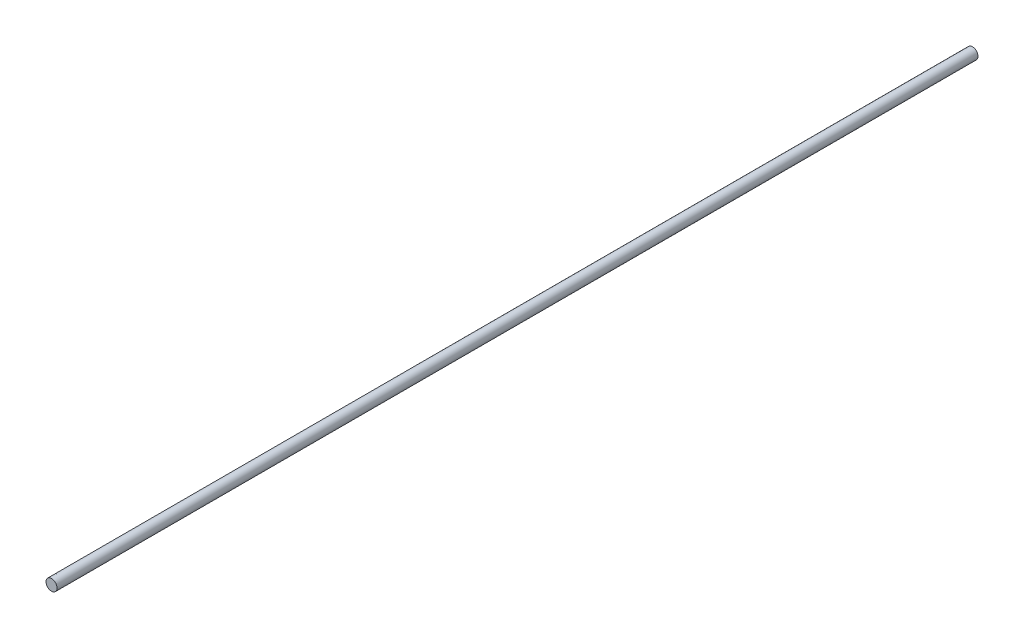
ISO-10303-21;
HEADER;
FILE_DESCRIPTION(('STEP AP214'),'2;1');
FILE_NAME('part.step','',(''),(''),'','','');
FILE_SCHEMA(('AUTOMOTIVE_DESIGN { 1 0 10303 214 1 1 1 1 }'));
ENDSEC;
DATA;
#1=APPLICATION_CONTEXT('core data for automotive mechanical design processes');
#2=APPLICATION_PROTOCOL_DEFINITION('international standard','automotive_design',2000,#1);
#3=PRODUCT_CONTEXT('',#1,'mechanical');
#4=PRODUCT('Part','Part','',(#3));
#5=PRODUCT_RELATED_PRODUCT_CATEGORY('part','',(#4));
#6=PRODUCT_DEFINITION_FORMATION('','',#4);
#7=PRODUCT_DEFINITION_CONTEXT('part definition',#1,'design');
#8=PRODUCT_DEFINITION('design','',#6,#7);
#9=PRODUCT_DEFINITION_SHAPE('','',#8);
#10=(LENGTH_UNIT() NAMED_UNIT(*) SI_UNIT(.MILLI.,.METRE.));
#11=(NAMED_UNIT(*) PLANE_ANGLE_UNIT() SI_UNIT($,.RADIAN.));
#12=(NAMED_UNIT(*) SI_UNIT($,.STERADIAN.) SOLID_ANGLE_UNIT());
#13=UNCERTAINTY_MEASURE_WITH_UNIT(LENGTH_MEASURE(1.E-05),#10,'distance_accuracy_value','');
#14=(GEOMETRIC_REPRESENTATION_CONTEXT(3) GLOBAL_UNCERTAINTY_ASSIGNED_CONTEXT((#13)) GLOBAL_UNIT_ASSIGNED_CONTEXT((#10,
#11,#12)) REPRESENTATION_CONTEXT('',''));
#15=CARTESIAN_POINT('',(0.,0.,0.));
#16=DIRECTION('',(0.,0.,1.));
#17=DIRECTION('',(1.,0.,0.));
#18=AXIS2_PLACEMENT_3D('',#15,#16,#17);
#19=CARTESIAN_POINT('',(0.,0.,1000.));
#20=DIRECTION('',(0.,0.,-1.));
#21=DIRECTION('',(-1.,0.,0.));
#22=AXIS2_PLACEMENT_3D('',#19,#20,#21);
#23=CYLINDRICAL_SURFACE('',#22,6.);
#24=CARTESIAN_POINT('',(0.,0.,1000.));
#25=DIRECTION('',(0.,0.,1.));
#26=DIRECTION('',(1.,0.,0.));
#27=AXIS2_PLACEMENT_3D('',#24,#25,#26);
#28=CIRCLE('',#27,6.);
#29=CARTESIAN_POINT('',(6.,0.,1000.));
#30=VERTEX_POINT('',#29);
#31=EDGE_CURVE('E10',#30,#30,#28,.T.);
#32=ORIENTED_EDGE('',*,*,#31,.F.);
#33=EDGE_LOOP('',(#32));
#34=FACE_BOUND('',#33,.T.);
#35=CARTESIAN_POINT('',(0.,0.,0.));
#36=DIRECTION('',(0.,0.,1.));
#37=DIRECTION('',(1.,0.,0.));
#38=AXIS2_PLACEMENT_3D('',#35,#36,#37);
#39=CIRCLE('',#38,6.);
#40=CARTESIAN_POINT('',(6.,0.,0.));
#41=VERTEX_POINT('',#40);
#42=EDGE_CURVE('E37',#41,#41,#39,.T.);
#43=ORIENTED_EDGE('',*,*,#42,.T.);
#44=EDGE_LOOP('',(#43));
#45=FACE_BOUND('',#44,.T.);
#46=ADVANCED_FACE('F34',(#34,#45),#23,.T.);
#47=CARTESIAN_POINT('',(0.,0.,1000.));
#48=DIRECTION('',(0.,0.,1.));
#49=DIRECTION('',(1.,0.,0.));
#50=AXIS2_PLACEMENT_3D('',#47,#48,#49);
#51=PLANE('',#50);
#52=ORIENTED_EDGE('',*,*,#31,.T.);
#53=EDGE_LOOP('',(#52));
#54=FACE_BOUND('',#53,.T.);
#55=ADVANCED_FACE('F49',(#54),#51,.T.);
#56=CARTESIAN_POINT('',(0.,0.,0.));
#57=DIRECTION('',(0.,0.,1.));
#58=DIRECTION('',(1.,0.,0.));
#59=AXIS2_PLACEMENT_3D('',#56,#57,#58);
#60=PLANE('',#59);
#61=ORIENTED_EDGE('',*,*,#42,.F.);
#62=EDGE_LOOP('',(#61));
#63=FACE_BOUND('',#62,.T.);
#64=ADVANCED_FACE('F47',(#63),#60,.F.);
#65=CLOSED_SHELL('',(#46,#55,#64));
#66=MANIFOLD_SOLID_BREP('B2',#65);
#67=ADVANCED_BREP_SHAPE_REPRESENTATION('',(#18,#66),#14);
#68=SHAPE_DEFINITION_REPRESENTATION(#9,#67);
ENDSEC;
END-ISO-10303-21;
